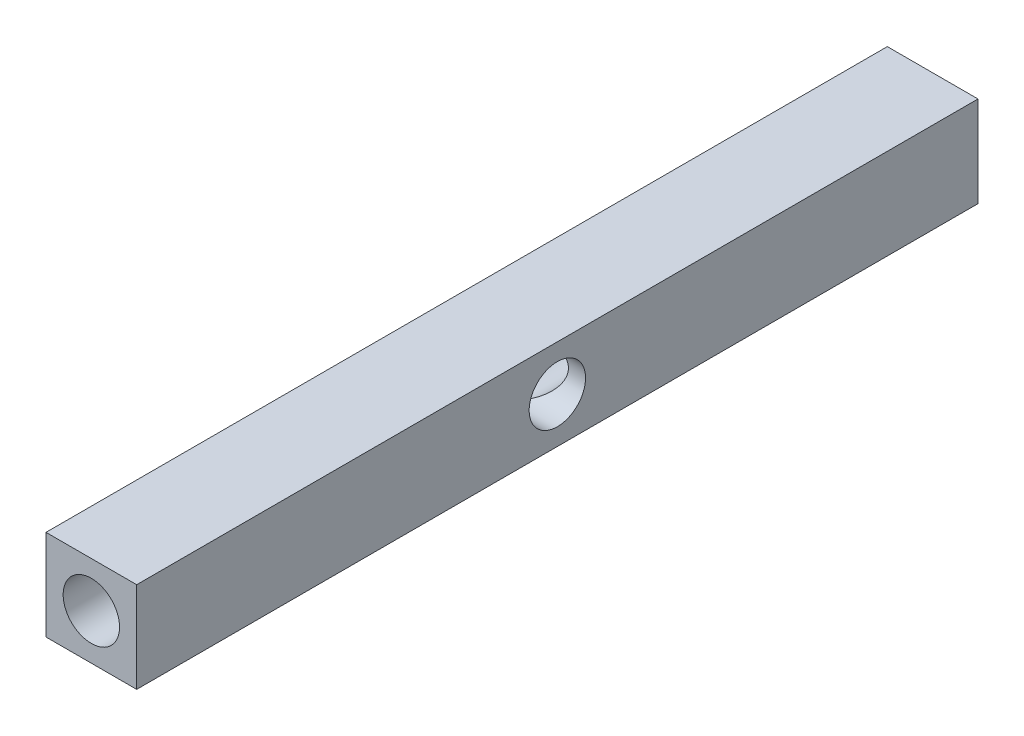
ISO-10303-21;
HEADER;
FILE_DESCRIPTION(('STEP AP214'),'2;1');
FILE_NAME('part.step','',(''),(''),'','','');
FILE_SCHEMA(('AUTOMOTIVE_DESIGN { 1 0 10303 214 1 1 1 1 }'));
ENDSEC;
DATA;
#1=APPLICATION_CONTEXT('core data for automotive mechanical design processes');
#2=APPLICATION_PROTOCOL_DEFINITION('international standard','automotive_design',2000,#1);
#3=PRODUCT_CONTEXT('',#1,'mechanical');
#4=PRODUCT('Part','Part','',(#3));
#5=PRODUCT_RELATED_PRODUCT_CATEGORY('part','',(#4));
#6=PRODUCT_DEFINITION_FORMATION('','',#4);
#7=PRODUCT_DEFINITION_CONTEXT('part definition',#1,'design');
#8=PRODUCT_DEFINITION('design','',#6,#7);
#9=PRODUCT_DEFINITION_SHAPE('','',#8);
#10=(LENGTH_UNIT() NAMED_UNIT(*) SI_UNIT(.MILLI.,.METRE.));
#11=(NAMED_UNIT(*) PLANE_ANGLE_UNIT() SI_UNIT($,.RADIAN.));
#12=(NAMED_UNIT(*) SI_UNIT($,.STERADIAN.) SOLID_ANGLE_UNIT());
#13=UNCERTAINTY_MEASURE_WITH_UNIT(LENGTH_MEASURE(1.E-05),#10,'distance_accuracy_value','');
#14=(GEOMETRIC_REPRESENTATION_CONTEXT(3) GLOBAL_UNCERTAINTY_ASSIGNED_CONTEXT((#13)) GLOBAL_UNIT_ASSIGNED_CONTEXT((#10,
#11,#12)) REPRESENTATION_CONTEXT('',''));
#15=CARTESIAN_POINT('',(0.,0.,0.));
#16=DIRECTION('',(0.,0.,1.));
#17=DIRECTION('',(1.,0.,0.));
#18=AXIS2_PLACEMENT_3D('',#15,#16,#17);
#19=CARTESIAN_POINT('',(0.,0.,-20.875));
#20=DIRECTION('',(0.,0.,1.));
#21=DIRECTION('',(1.,0.,0.));
#22=AXIS2_PLACEMENT_3D('',#19,#20,#21);
#23=CYLINDRICAL_SURFACE('',#22,1.4);
#24=CARTESIAN_POINT('',(0.,0.,20.875));
#25=DIRECTION('',(0.,0.,-1.));
#26=DIRECTION('',(-1.,0.,0.));
#27=AXIS2_PLACEMENT_3D('',#24,#25,#26);
#28=CIRCLE('',#27,1.4);
#29=CARTESIAN_POINT('',(-1.4,0.,20.875));
#30=VERTEX_POINT('',#29);
#31=EDGE_CURVE('E116',#30,#30,#28,.T.);
#32=ORIENTED_EDGE('',*,*,#31,.F.);
#33=EDGE_LOOP('',(#32));
#34=FACE_BOUND('',#33,.T.);
#35=CARTESIAN_POINT('',(0.,0.,0.));
#36=DIRECTION('',(0.707106781186548,0.,0.707106781186547));
#37=DIRECTION('',(-0.707106781186548,0.,0.707106781186547));
#38=AXIS2_PLACEMENT_3D('',#35,#36,#37);
#39=ELLIPSE('',#38,1.97989898732233,1.4);
#40=CARTESIAN_POINT('',(0.,-1.4,0.));
#41=VERTEX_POINT('',#40);
#42=CARTESIAN_POINT('',(0.,1.4,0.));
#43=VERTEX_POINT('',#42);
#44=EDGE_CURVE('E57',#41,#43,#39,.F.);
#45=ORIENTED_EDGE('',*,*,#44,.T.);
#46=CARTESIAN_POINT('',(0.,0.,0.));
#47=DIRECTION('',(-0.707106781186548,0.,0.707106781186547));
#48=DIRECTION('',(0.707106781186548,0.,0.707106781186547));
#49=AXIS2_PLACEMENT_3D('',#46,#47,#48);
#50=ELLIPSE('',#49,1.97989898732233,1.4);
#51=EDGE_CURVE('E11',#43,#41,#50,.F.);
#52=ORIENTED_EDGE('',*,*,#51,.T.);
#53=EDGE_LOOP('',(#45,#52));
#54=FACE_BOUND('',#53,.T.);
#55=ADVANCED_FACE('F43',(#34,#54),#23,.F.);
#56=CARTESIAN_POINT('',(2.25,2.25,20.875));
#57=DIRECTION('',(-1.,0.,0.));
#58=DIRECTION('',(0.,0.,1.));
#59=AXIS2_PLACEMENT_3D('',#56,#57,#58);
#60=PLANE('',#59);
#61=CARTESIAN_POINT('',(2.25,0.,0.));
#62=DIRECTION('',(-1.,0.,0.));
#63=DIRECTION('',(0.,0.,1.));
#64=AXIS2_PLACEMENT_3D('',#61,#62,#63);
#65=CIRCLE('',#64,1.4);
#66=CARTESIAN_POINT('',(2.25,0.,1.4));
#67=VERTEX_POINT('',#66);
#68=EDGE_CURVE('E158',#67,#67,#65,.T.);
#69=ORIENTED_EDGE('',*,*,#68,.T.);
#70=EDGE_LOOP('',(#69));
#71=FACE_BOUND('',#70,.T.);
#72=DIRECTION('',(0.,0.,-1.));
#73=VECTOR('',#72,1.);
#74=CARTESIAN_POINT('',(2.25,-2.25,20.875));
#75=LINE('',#74,#73);
#76=CARTESIAN_POINT('',(2.25,-2.25,20.875));
#77=VERTEX_POINT('',#76);
#78=CARTESIAN_POINT('',(2.25,-2.25,-20.875));
#79=VERTEX_POINT('',#78);
#80=EDGE_CURVE('E120',#77,#79,#75,.T.);
#81=ORIENTED_EDGE('',*,*,#80,.T.);
#82=DIRECTION('',(0.,-1.,0.));
#83=VECTOR('',#82,1.);
#84=CARTESIAN_POINT('',(2.25,2.25,-20.875));
#85=LINE('',#84,#83);
#86=CARTESIAN_POINT('',(2.25,2.25,-20.875));
#87=VERTEX_POINT('',#86);
#88=EDGE_CURVE('E110',#87,#79,#85,.T.);
#89=ORIENTED_EDGE('',*,*,#88,.F.);
#90=DIRECTION('',(0.,0.,-1.));
#91=VECTOR('',#90,1.);
#92=CARTESIAN_POINT('',(2.25,2.25,20.875));
#93=LINE('',#92,#91);
#94=CARTESIAN_POINT('',(2.25,2.25,20.875));
#95=VERTEX_POINT('',#94);
#96=EDGE_CURVE('E136',#95,#87,#93,.T.);
#97=ORIENTED_EDGE('',*,*,#96,.F.);
#98=DIRECTION('',(0.,-1.,0.));
#99=VECTOR('',#98,1.);
#100=CARTESIAN_POINT('',(2.25,2.25,20.875));
#101=LINE('',#100,#99);
#102=EDGE_CURVE('E131',#95,#77,#101,.T.);
#103=ORIENTED_EDGE('',*,*,#102,.T.);
#104=EDGE_LOOP('',(#81,#89,#97,#103));
#105=FACE_BOUND('',#104,.T.);
#106=ADVANCED_FACE('F45',(#71,#105),#60,.F.);
#107=CARTESIAN_POINT('',(-2.25,2.25,-20.875));
#108=DIRECTION('',(0.,0.,1.));
#109=DIRECTION('',(1.,0.,0.));
#110=AXIS2_PLACEMENT_3D('',#107,#108,#109);
#111=PLANE('',#110);
#112=CARTESIAN_POINT('',(0.,0.,-20.875));
#113=DIRECTION('',(0.,0.,1.));
#114=DIRECTION('',(1.,0.,0.));
#115=AXIS2_PLACEMENT_3D('',#112,#113,#114);
#116=CIRCLE('',#115,1.4);
#117=CARTESIAN_POINT('',(1.4,0.,-20.875));
#118=VERTEX_POINT('',#117);
#119=EDGE_CURVE('E121',#118,#118,#116,.T.);
#120=ORIENTED_EDGE('',*,*,#119,.T.);
#121=EDGE_LOOP('',(#120));
#122=FACE_BOUND('',#121,.T.);
#123=DIRECTION('',(-1.,0.,0.));
#124=VECTOR('',#123,1.);
#125=CARTESIAN_POINT('',(-2.25,-2.25,-20.875));
#126=LINE('',#125,#124);
#127=CARTESIAN_POINT('',(-2.25,-2.25,-20.875));
#128=VERTEX_POINT('',#127);
#129=EDGE_CURVE('E140',#79,#128,#126,.T.);
#130=ORIENTED_EDGE('',*,*,#129,.T.);
#131=DIRECTION('',(0.,-1.,0.));
#132=VECTOR('',#131,1.);
#133=CARTESIAN_POINT('',(-2.25,2.25,-20.875));
#134=LINE('',#133,#132);
#135=CARTESIAN_POINT('',(-2.25,2.25,-20.875));
#136=VERTEX_POINT('',#135);
#137=EDGE_CURVE('E124',#136,#128,#134,.T.);
#138=ORIENTED_EDGE('',*,*,#137,.F.);
#139=DIRECTION('',(-1.,0.,0.));
#140=VECTOR('',#139,1.);
#141=CARTESIAN_POINT('',(-2.25,2.25,-20.875));
#142=LINE('',#141,#140);
#143=EDGE_CURVE('E95',#87,#136,#142,.T.);
#144=ORIENTED_EDGE('',*,*,#143,.F.);
#145=ORIENTED_EDGE('',*,*,#88,.T.);
#146=EDGE_LOOP('',(#130,#138,#144,#145));
#147=FACE_BOUND('',#146,.T.);
#148=ADVANCED_FACE('F182',(#122,#147),#111,.F.);
#149=CARTESIAN_POINT('',(-2.25,2.25,20.875));
#150=DIRECTION('',(1.,0.,0.));
#151=DIRECTION('',(0.,0.,-1.));
#152=AXIS2_PLACEMENT_3D('',#149,#150,#151);
#153=PLANE('',#152);
#154=CARTESIAN_POINT('',(-2.25,0.,0.));
#155=DIRECTION('',(-1.,0.,0.));
#156=DIRECTION('',(0.,0.,1.));
#157=AXIS2_PLACEMENT_3D('',#154,#155,#156);
#158=CIRCLE('',#157,1.4);
#159=CARTESIAN_POINT('',(-2.25,0.,1.4));
#160=VERTEX_POINT('',#159);
#161=EDGE_CURVE('E159',#160,#160,#158,.T.);
#162=ORIENTED_EDGE('',*,*,#161,.F.);
#163=EDGE_LOOP('',(#162));
#164=FACE_BOUND('',#163,.T.);
#165=DIRECTION('',(0.,0.,1.));
#166=VECTOR('',#165,1.);
#167=CARTESIAN_POINT('',(-2.25,-2.25,20.875));
#168=LINE('',#167,#166);
#169=CARTESIAN_POINT('',(-2.25,-2.25,20.875));
#170=VERTEX_POINT('',#169);
#171=EDGE_CURVE('E137',#128,#170,#168,.T.);
#172=ORIENTED_EDGE('',*,*,#171,.T.);
#173=DIRECTION('',(0.,-1.,0.));
#174=VECTOR('',#173,1.);
#175=CARTESIAN_POINT('',(-2.25,2.25,20.875));
#176=LINE('',#175,#174);
#177=CARTESIAN_POINT('',(-2.25,2.25,20.875));
#178=VERTEX_POINT('',#177);
#179=EDGE_CURVE('E128',#178,#170,#176,.T.);
#180=ORIENTED_EDGE('',*,*,#179,.F.);
#181=DIRECTION('',(0.,0.,1.));
#182=VECTOR('',#181,1.);
#183=CARTESIAN_POINT('',(-2.25,2.25,20.875));
#184=LINE('',#183,#182);
#185=EDGE_CURVE('E148',#136,#178,#184,.T.);
#186=ORIENTED_EDGE('',*,*,#185,.F.);
#187=ORIENTED_EDGE('',*,*,#137,.T.);
#188=EDGE_LOOP('',(#172,#180,#186,#187));
#189=FACE_BOUND('',#188,.T.);
#190=ADVANCED_FACE('F202',(#164,#189),#153,.F.);
#191=CARTESIAN_POINT('',(-2.25,2.25,20.875));
#192=DIRECTION('',(0.,0.,-1.));
#193=DIRECTION('',(-1.,0.,0.));
#194=AXIS2_PLACEMENT_3D('',#191,#192,#193);
#195=PLANE('',#194);
#196=ORIENTED_EDGE('',*,*,#31,.T.);
#197=EDGE_LOOP('',(#196));
#198=FACE_BOUND('',#197,.T.);
#199=DIRECTION('',(1.,0.,0.));
#200=VECTOR('',#199,1.);
#201=CARTESIAN_POINT('',(-2.25,-2.25,20.875));
#202=LINE('',#201,#200);
#203=EDGE_CURVE('E87',#170,#77,#202,.T.);
#204=ORIENTED_EDGE('',*,*,#203,.T.);
#205=ORIENTED_EDGE('',*,*,#102,.F.);
#206=DIRECTION('',(1.,0.,0.));
#207=VECTOR('',#206,1.);
#208=CARTESIAN_POINT('',(-2.25,2.25,20.875));
#209=LINE('',#208,#207);
#210=EDGE_CURVE('E66',#178,#95,#209,.T.);
#211=ORIENTED_EDGE('',*,*,#210,.F.);
#212=ORIENTED_EDGE('',*,*,#179,.T.);
#213=EDGE_LOOP('',(#204,#205,#211,#212));
#214=FACE_BOUND('',#213,.T.);
#215=ADVANCED_FACE('F198',(#198,#214),#195,.F.);
#216=CARTESIAN_POINT('',(0.,2.25,0.));
#217=DIRECTION('',(0.,-1.,0.));
#218=DIRECTION('',(0.,0.,-1.));
#219=AXIS2_PLACEMENT_3D('',#216,#217,#218);
#220=PLANE('',#219);
#221=ORIENTED_EDGE('',*,*,#96,.T.);
#222=ORIENTED_EDGE('',*,*,#143,.T.);
#223=ORIENTED_EDGE('',*,*,#185,.T.);
#224=ORIENTED_EDGE('',*,*,#210,.T.);
#225=EDGE_LOOP('',(#221,#222,#223,#224));
#226=FACE_BOUND('',#225,.T.);
#227=ADVANCED_FACE('F191',(#226),#220,.F.);
#228=CARTESIAN_POINT('',(0.,-2.25,0.));
#229=DIRECTION('',(0.,-1.,0.));
#230=DIRECTION('',(0.,0.,-1.));
#231=AXIS2_PLACEMENT_3D('',#228,#229,#230);
#232=PLANE('',#231);
#233=ORIENTED_EDGE('',*,*,#80,.F.);
#234=ORIENTED_EDGE('',*,*,#203,.F.);
#235=ORIENTED_EDGE('',*,*,#171,.F.);
#236=ORIENTED_EDGE('',*,*,#129,.F.);
#237=EDGE_LOOP('',(#233,#234,#235,#236));
#238=FACE_BOUND('',#237,.T.);
#239=ADVANCED_FACE('F186',(#238),#232,.T.);
#240=CARTESIAN_POINT('',(0.,0.,0.));
#241=DIRECTION('',(0.707106781186548,0.,0.707106781186547));
#242=DIRECTION('',(-0.707106781186548,0.,0.707106781186547));
#243=AXIS2_PLACEMENT_3D('',#240,#241,#242);
#244=ELLIPSE('',#243,1.97989898732233,1.4);
#245=EDGE_CURVE('E101',#41,#43,#244,.T.);
#246=ORIENTED_EDGE('',*,*,#245,.T.);
#247=CARTESIAN_POINT('',(0.,0.,0.));
#248=DIRECTION('',(-0.707106781186548,0.,0.707106781186547));
#249=DIRECTION('',(0.707106781186548,0.,0.707106781186547));
#250=AXIS2_PLACEMENT_3D('',#247,#248,#249);
#251=ELLIPSE('',#250,1.97989898732233,1.4);
#252=EDGE_CURVE('E52',#43,#41,#251,.T.);
#253=ORIENTED_EDGE('',*,*,#252,.T.);
#254=EDGE_LOOP('',(#246,#253));
#255=FACE_BOUND('',#254,.T.);
#256=ORIENTED_EDGE('',*,*,#119,.F.);
#257=EDGE_LOOP('',(#256));
#258=FACE_BOUND('',#257,.T.);
#259=ADVANCED_FACE('F112',(#255,#258),#23,.F.);
#260=CARTESIAN_POINT('',(2.25,0.,0.));
#261=DIRECTION('',(-1.,0.,0.));
#262=DIRECTION('',(0.,0.,1.));
#263=AXIS2_PLACEMENT_3D('',#260,#261,#262);
#264=CYLINDRICAL_SURFACE('',#263,1.4);
#265=ORIENTED_EDGE('',*,*,#161,.T.);
#266=EDGE_LOOP('',(#265));
#267=FACE_BOUND('',#266,.T.);
#268=ORIENTED_EDGE('',*,*,#44,.F.);
#269=ORIENTED_EDGE('',*,*,#252,.F.);
#270=EDGE_LOOP('',(#268,#269));
#271=FACE_BOUND('',#270,.T.);
#272=ADVANCED_FACE('F108',(#267,#271),#264,.F.);
#273=ORIENTED_EDGE('',*,*,#68,.F.);
#274=EDGE_LOOP('',(#273));
#275=FACE_BOUND('',#274,.T.);
#276=ORIENTED_EDGE('',*,*,#245,.F.);
#277=ORIENTED_EDGE('',*,*,#51,.F.);
#278=EDGE_LOOP('',(#276,#277));
#279=FACE_BOUND('',#278,.T.);
#280=ADVANCED_FACE('F102',(#275,#279),#264,.F.);
#281=CLOSED_SHELL('',(#55,#106,#148,#190,#215,#227,#239,#259,#272,#280));
#282=MANIFOLD_SOLID_BREP('B2',#281);
#283=ADVANCED_BREP_SHAPE_REPRESENTATION('',(#18,#282),#14);
#284=SHAPE_DEFINITION_REPRESENTATION(#9,#283);
ENDSEC;
END-ISO-10303-21;
